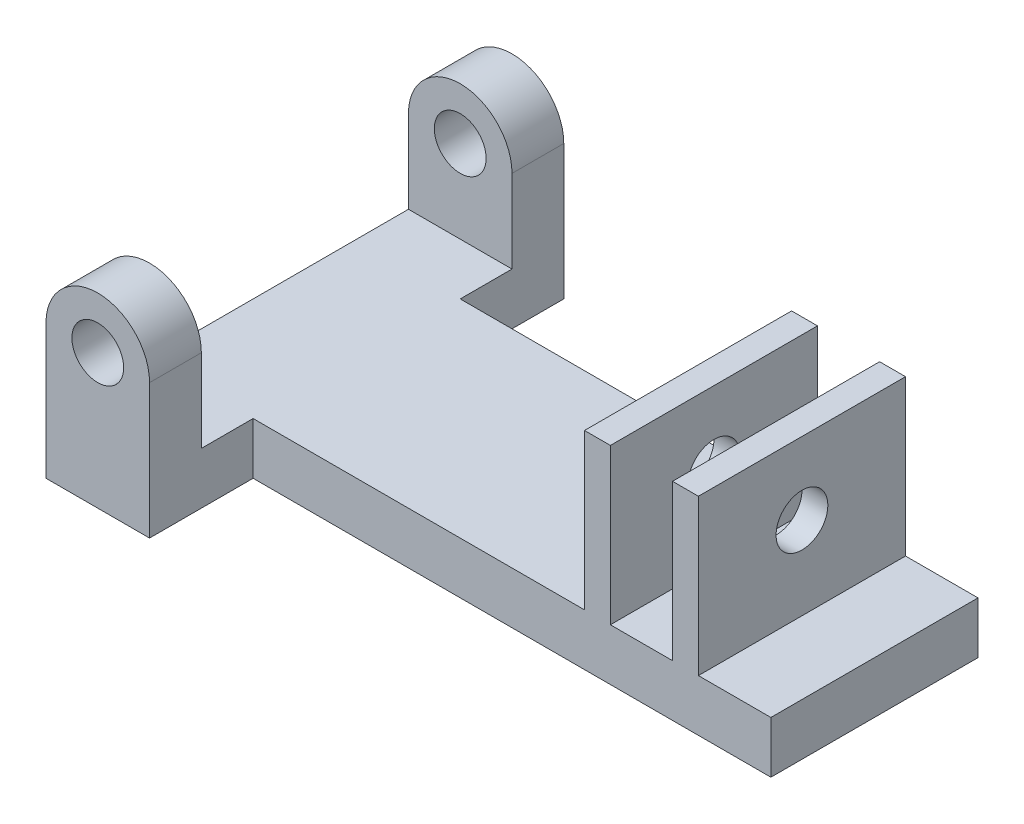
ISO-10303-21;
HEADER;
FILE_DESCRIPTION(('STEP AP214'),'2;1');
FILE_NAME('part.step','',(''),(''),'','','');
FILE_SCHEMA(('AUTOMOTIVE_DESIGN { 1 0 10303 214 1 1 1 1 }'));
ENDSEC;
DATA;
#1=APPLICATION_CONTEXT('core data for automotive mechanical design processes');
#2=APPLICATION_PROTOCOL_DEFINITION('international standard','automotive_design',2000,#1);
#3=PRODUCT_CONTEXT('',#1,'mechanical');
#4=PRODUCT('Part','Part','',(#3));
#5=PRODUCT_RELATED_PRODUCT_CATEGORY('part','',(#4));
#6=PRODUCT_DEFINITION_FORMATION('','',#4);
#7=PRODUCT_DEFINITION_CONTEXT('part definition',#1,'design');
#8=PRODUCT_DEFINITION('design','',#6,#7);
#9=PRODUCT_DEFINITION_SHAPE('','',#8);
#10=(LENGTH_UNIT() NAMED_UNIT(*) SI_UNIT(.MILLI.,.METRE.));
#11=(NAMED_UNIT(*) PLANE_ANGLE_UNIT() SI_UNIT($,.RADIAN.));
#12=(NAMED_UNIT(*) SI_UNIT($,.STERADIAN.) SOLID_ANGLE_UNIT());
#13=UNCERTAINTY_MEASURE_WITH_UNIT(LENGTH_MEASURE(1.E-05),#10,'distance_accuracy_value','');
#14=(GEOMETRIC_REPRESENTATION_CONTEXT(3) GLOBAL_UNCERTAINTY_ASSIGNED_CONTEXT((#13)) GLOBAL_UNIT_ASSIGNED_CONTEXT((#10,
#11,#12)) REPRESENTATION_CONTEXT('',''));
#15=CARTESIAN_POINT('',(0.,0.,0.));
#16=DIRECTION('',(0.,0.,1.));
#17=DIRECTION('',(1.,0.,0.));
#18=AXIS2_PLACEMENT_3D('',#15,#16,#17);
#19=CARTESIAN_POINT('',(0.,6.35,0.));
#20=DIRECTION('',(0.,-1.,0.));
#21=DIRECTION('',(0.,0.,-1.));
#22=AXIS2_PLACEMENT_3D('',#19,#20,#21);
#23=PLANE('',#22);
#24=DIRECTION('',(0.,0.,-1.));
#25=VECTOR('',#24,1.);
#26=CARTESIAN_POINT('',(54.61,6.35,-38.1));
#27=LINE('',#26,#25);
#28=CARTESIAN_POINT('',(54.61,6.35,-12.7));
#29=VERTEX_POINT('',#28);
#30=CARTESIAN_POINT('',(54.61,6.35,-38.1));
#31=VERTEX_POINT('',#30);
#32=EDGE_CURVE('E64',#29,#31,#27,.T.);
#33=ORIENTED_EDGE('',*,*,#32,.F.);
#34=DIRECTION('',(-1.,0.,0.));
#35=VECTOR('',#34,1.);
#36=CARTESIAN_POINT('',(63.5,6.35,-12.7));
#37=LINE('',#36,#35);
#38=CARTESIAN_POINT('',(63.5,6.35,-12.7));
#39=VERTEX_POINT('',#38);
#40=EDGE_CURVE('E261',#39,#29,#37,.T.);
#41=ORIENTED_EDGE('',*,*,#40,.F.);
#42=DIRECTION('',(0.,0.,1.));
#43=VECTOR('',#42,1.);
#44=CARTESIAN_POINT('',(63.5,6.35,-12.7));
#45=LINE('',#44,#43);
#46=CARTESIAN_POINT('',(63.5,6.35,-38.1));
#47=VERTEX_POINT('',#46);
#48=EDGE_CURVE('E255',#47,#39,#45,.T.);
#49=ORIENTED_EDGE('',*,*,#48,.F.);
#50=DIRECTION('',(-1.,0.,0.));
#51=VECTOR('',#50,1.);
#52=CARTESIAN_POINT('',(63.5,6.35,-38.1));
#53=LINE('',#52,#51);
#54=EDGE_CURVE('E190',#47,#31,#53,.T.);
#55=ORIENTED_EDGE('',*,*,#54,.T.);
#56=EDGE_LOOP('',(#33,#41,#49,#55));
#57=FACE_BOUND('',#56,.T.);
#58=ADVANCED_FACE('F40',(#57),#23,.F.);
#59=DIRECTION('',(0.,0.,1.));
#60=VECTOR('',#59,1.);
#61=CARTESIAN_POINT('',(51.435,6.35,-38.1));
#62=LINE('',#61,#60);
#63=CARTESIAN_POINT('',(51.435,6.35,-38.1));
#64=VERTEX_POINT('',#63);
#65=CARTESIAN_POINT('',(51.435,6.35,-12.7));
#66=VERTEX_POINT('',#65);
#67=EDGE_CURVE('E193',#64,#66,#62,.T.);
#68=ORIENTED_EDGE('',*,*,#67,.F.);
#69=CARTESIAN_POINT('',(43.815,6.35,-38.1));
#70=VERTEX_POINT('',#69);
#71=EDGE_CURVE('E180',#64,#70,#53,.T.);
#72=ORIENTED_EDGE('',*,*,#71,.T.);
#73=DIRECTION('',(0.,0.,-1.));
#74=VECTOR('',#73,1.);
#75=CARTESIAN_POINT('',(43.815,6.35,-38.1));
#76=LINE('',#75,#74);
#77=CARTESIAN_POINT('',(43.815,6.35,-12.7));
#78=VERTEX_POINT('',#77);
#79=EDGE_CURVE('E227',#78,#70,#76,.T.);
#80=ORIENTED_EDGE('',*,*,#79,.F.);
#81=EDGE_CURVE('E56',#66,#78,#37,.T.);
#82=ORIENTED_EDGE('',*,*,#81,.F.);
#83=EDGE_LOOP('',(#68,#72,#80,#82));
#84=FACE_BOUND('',#83,.T.);
#85=ADVANCED_FACE('F194',(#84),#23,.F.);
#86=DIRECTION('',(0.,0.,1.));
#87=VECTOR('',#86,1.);
#88=CARTESIAN_POINT('',(40.64,6.35,-38.1));
#89=LINE('',#88,#87);
#90=CARTESIAN_POINT('',(40.64,6.35,-38.1));
#91=VERTEX_POINT('',#90);
#92=CARTESIAN_POINT('',(40.64,6.35,-12.7));
#93=VERTEX_POINT('',#92);
#94=EDGE_CURVE('E216',#91,#93,#89,.T.);
#95=ORIENTED_EDGE('',*,*,#94,.F.);
#96=CARTESIAN_POINT('',(0.,6.35,-38.1));
#97=VERTEX_POINT('',#96);
#98=EDGE_CURVE('E191',#91,#97,#53,.T.);
#99=ORIENTED_EDGE('',*,*,#98,.T.);
#100=DIRECTION('',(0.,0.,-1.));
#101=VECTOR('',#100,1.);
#102=CARTESIAN_POINT('',(0.,6.35,0.));
#103=LINE('',#102,#101);
#104=CARTESIAN_POINT('',(0.,6.35,-44.45));
#105=VERTEX_POINT('',#104);
#106=EDGE_CURVE('E326',#97,#105,#103,.T.);
#107=ORIENTED_EDGE('',*,*,#106,.T.);
#108=DIRECTION('',(-1.,0.,0.));
#109=VECTOR('',#108,1.);
#110=CARTESIAN_POINT('',(-12.7,6.35,-44.45));
#111=LINE('',#110,#109);
#112=CARTESIAN_POINT('',(-12.7,6.35,-44.45));
#113=VERTEX_POINT('',#112);
#114=EDGE_CURVE('E289',#105,#113,#111,.T.);
#115=ORIENTED_EDGE('',*,*,#114,.T.);
#116=DIRECTION('',(0.,0.,1.));
#117=VECTOR('',#116,1.);
#118=CARTESIAN_POINT('',(-12.7,6.35,0.));
#119=LINE('',#118,#117);
#120=CARTESIAN_POINT('',(-12.7,6.35,-6.35));
#121=VERTEX_POINT('',#120);
#122=EDGE_CURVE('E325',#113,#121,#119,.T.);
#123=ORIENTED_EDGE('',*,*,#122,.T.);
#124=DIRECTION('',(-1.,0.,0.));
#125=VECTOR('',#124,1.);
#126=CARTESIAN_POINT('',(-12.7,6.35,-6.35));
#127=LINE('',#126,#125);
#128=CARTESIAN_POINT('',(0.,6.35,-6.35));
#129=VERTEX_POINT('',#128);
#130=EDGE_CURVE('E306',#129,#121,#127,.T.);
#131=ORIENTED_EDGE('',*,*,#130,.F.);
#132=CARTESIAN_POINT('',(0.,6.35,-12.7));
#133=VERTEX_POINT('',#132);
#134=EDGE_CURVE('E322',#129,#133,#103,.T.);
#135=ORIENTED_EDGE('',*,*,#134,.T.);
#136=EDGE_CURVE('E257',#93,#133,#37,.T.);
#137=ORIENTED_EDGE('',*,*,#136,.F.);
#138=EDGE_LOOP('',(#95,#99,#107,#115,#123,#131,#135,#137));
#139=FACE_BOUND('',#138,.T.);
#140=ADVANCED_FACE('F371',(#139),#23,.F.);
#141=CARTESIAN_POINT('',(0.,6.35,0.));
#142=DIRECTION('',(-1.,0.,0.));
#143=DIRECTION('',(0.,0.,1.));
#144=AXIS2_PLACEMENT_3D('',#141,#142,#143);
#145=PLANE('',#144);
#146=DIRECTION('',(0.,-1.,0.));
#147=VECTOR('',#146,1.);
#148=CARTESIAN_POINT('',(0.,6.35,-12.7));
#149=LINE('',#148,#147);
#150=CARTESIAN_POINT('',(0.,0.,-12.7));
#151=VERTEX_POINT('',#150);
#152=EDGE_CURVE('E246',#133,#151,#149,.T.);
#153=ORIENTED_EDGE('',*,*,#152,.F.);
#154=ORIENTED_EDGE('',*,*,#134,.F.);
#155=DIRECTION('',(0.,-1.,0.));
#156=VECTOR('',#155,1.);
#157=CARTESIAN_POINT('',(0.,16.51,-6.35));
#158=LINE('',#157,#156);
#159=CARTESIAN_POINT('',(0.,16.51,-6.35));
#160=VERTEX_POINT('',#159);
#161=EDGE_CURVE('E318',#160,#129,#158,.T.);
#162=ORIENTED_EDGE('',*,*,#161,.F.);
#163=DIRECTION('',(0.,0.,-1.));
#164=VECTOR('',#163,1.);
#165=CARTESIAN_POINT('',(0.,16.51,0.));
#166=LINE('',#165,#164);
#167=CARTESIAN_POINT('',(0.,16.51,0.));
#168=VERTEX_POINT('',#167);
#169=EDGE_CURVE('E310',#168,#160,#166,.T.);
#170=ORIENTED_EDGE('',*,*,#169,.F.);
#171=DIRECTION('',(0.,-1.,0.));
#172=VECTOR('',#171,1.);
#173=CARTESIAN_POINT('',(0.,6.35,0.));
#174=LINE('',#173,#172);
#175=CARTESIAN_POINT('',(0.,0.,0.));
#176=VERTEX_POINT('',#175);
#177=EDGE_CURVE('E328',#168,#176,#174,.T.);
#178=ORIENTED_EDGE('',*,*,#177,.T.);
#179=DIRECTION('',(0.,0.,-1.));
#180=VECTOR('',#179,1.);
#181=CARTESIAN_POINT('',(0.,0.,0.));
#182=LINE('',#181,#180);
#183=EDGE_CURVE('E329',#176,#151,#182,.T.);
#184=ORIENTED_EDGE('',*,*,#183,.T.);
#185=EDGE_LOOP('',(#153,#154,#162,#170,#178,#184));
#186=FACE_BOUND('',#185,.T.);
#187=ADVANCED_FACE('F42',(#186),#145,.F.);
#188=DIRECTION('',(0.,1.,0.));
#189=VECTOR('',#188,1.);
#190=CARTESIAN_POINT('',(0.,6.35,-38.1));
#191=LINE('',#190,#189);
#192=CARTESIAN_POINT('',(0.,0.,-38.1));
#193=VERTEX_POINT('',#192);
#194=EDGE_CURVE('E251',#193,#97,#191,.T.);
#195=ORIENTED_EDGE('',*,*,#194,.F.);
#196=CARTESIAN_POINT('',(0.,0.,-50.8));
#197=VERTEX_POINT('',#196);
#198=EDGE_CURVE('E321',#193,#197,#182,.T.);
#199=ORIENTED_EDGE('',*,*,#198,.T.);
#200=DIRECTION('',(0.,-1.,0.));
#201=VECTOR('',#200,1.);
#202=CARTESIAN_POINT('',(0.,6.35,-50.8));
#203=LINE('',#202,#201);
#204=CARTESIAN_POINT('',(0.,16.51,-50.8));
#205=VERTEX_POINT('',#204);
#206=EDGE_CURVE('E11',#205,#197,#203,.T.);
#207=ORIENTED_EDGE('',*,*,#206,.F.);
#208=DIRECTION('',(0.,0.,1.));
#209=VECTOR('',#208,1.);
#210=CARTESIAN_POINT('',(0.,16.51,-50.8));
#211=LINE('',#210,#209);
#212=CARTESIAN_POINT('',(0.,16.51,-44.45));
#213=VERTEX_POINT('',#212);
#214=EDGE_CURVE('E295',#205,#213,#211,.T.);
#215=ORIENTED_EDGE('',*,*,#214,.T.);
#216=DIRECTION('',(0.,-1.,0.));
#217=VECTOR('',#216,1.);
#218=CARTESIAN_POINT('',(0.,16.51,-44.45));
#219=LINE('',#218,#217);
#220=EDGE_CURVE('E298',#213,#105,#219,.T.);
#221=ORIENTED_EDGE('',*,*,#220,.T.);
#222=ORIENTED_EDGE('',*,*,#106,.F.);
#223=EDGE_LOOP('',(#195,#199,#207,#215,#221,#222));
#224=FACE_BOUND('',#223,.T.);
#225=ADVANCED_FACE('F383',(#224),#145,.F.);
#226=CARTESIAN_POINT('',(-12.7,6.35,-50.8));
#227=DIRECTION('',(0.,0.,1.));
#228=DIRECTION('',(1.,0.,0.));
#229=AXIS2_PLACEMENT_3D('',#226,#227,#228);
#230=PLANE('',#229);
#231=CARTESIAN_POINT('',(-6.35,16.51,-50.8));
#232=DIRECTION('',(0.,0.,1.));
#233=DIRECTION('',(1.,0.,0.));
#234=AXIS2_PLACEMENT_3D('',#231,#232,#233);
#235=CIRCLE('',#234,3.175);
#236=CARTESIAN_POINT('',(-3.175,16.51,-50.8));
#237=VERTEX_POINT('',#236);
#238=EDGE_CURVE('E269',#237,#237,#235,.T.);
#239=ORIENTED_EDGE('',*,*,#238,.T.);
#240=EDGE_LOOP('',(#239));
#241=FACE_BOUND('',#240,.T.);
#242=DIRECTION('',(-1.,0.,0.));
#243=VECTOR('',#242,1.);
#244=CARTESIAN_POINT('',(-12.7,0.,-50.8));
#245=LINE('',#244,#243);
#246=CARTESIAN_POINT('',(-12.7,0.,-50.8));
#247=VERTEX_POINT('',#246);
#248=EDGE_CURVE('E331',#197,#247,#245,.T.);
#249=ORIENTED_EDGE('',*,*,#248,.T.);
#250=DIRECTION('',(0.,-1.,0.));
#251=VECTOR('',#250,1.);
#252=CARTESIAN_POINT('',(-12.7,6.35,-50.8));
#253=LINE('',#252,#251);
#254=CARTESIAN_POINT('',(-12.7,16.51,-50.8));
#255=VERTEX_POINT('',#254);
#256=EDGE_CURVE('E49',#255,#247,#253,.T.);
#257=ORIENTED_EDGE('',*,*,#256,.F.);
#258=CARTESIAN_POINT('',(-6.35,16.51,-50.8));
#259=DIRECTION('',(0.,0.,1.));
#260=DIRECTION('',(-1.,0.,0.));
#261=AXIS2_PLACEMENT_3D('',#258,#259,#260);
#262=CIRCLE('',#261,6.35);
#263=EDGE_CURVE('E275',#205,#255,#262,.T.);
#264=ORIENTED_EDGE('',*,*,#263,.F.);
#265=ORIENTED_EDGE('',*,*,#206,.T.);
#266=EDGE_LOOP('',(#249,#257,#264,#265));
#267=FACE_BOUND('',#266,.T.);
#268=ADVANCED_FACE('F380',(#241,#267),#230,.F.);
#269=CARTESIAN_POINT('',(-12.7,6.35,0.));
#270=DIRECTION('',(1.,0.,0.));
#271=DIRECTION('',(0.,0.,-1.));
#272=AXIS2_PLACEMENT_3D('',#269,#270,#271);
#273=PLANE('',#272);
#274=DIRECTION('',(0.,0.,1.));
#275=VECTOR('',#274,1.);
#276=CARTESIAN_POINT('',(-12.7,0.,0.));
#277=LINE('',#276,#275);
#278=CARTESIAN_POINT('',(-12.7,0.,0.));
#279=VERTEX_POINT('',#278);
#280=EDGE_CURVE('E333',#247,#279,#277,.T.);
#281=ORIENTED_EDGE('',*,*,#280,.T.);
#282=DIRECTION('',(0.,-1.,0.));
#283=VECTOR('',#282,1.);
#284=CARTESIAN_POINT('',(-12.7,6.35,0.));
#285=LINE('',#284,#283);
#286=CARTESIAN_POINT('',(-12.7,16.51,0.));
#287=VERTEX_POINT('',#286);
#288=EDGE_CURVE('E339',#287,#279,#285,.T.);
#289=ORIENTED_EDGE('',*,*,#288,.F.);
#290=DIRECTION('',(0.,0.,1.));
#291=VECTOR('',#290,1.);
#292=CARTESIAN_POINT('',(-12.7,16.51,0.));
#293=LINE('',#292,#291);
#294=CARTESIAN_POINT('',(-12.7,16.51,-6.35));
#295=VERTEX_POINT('',#294);
#296=EDGE_CURVE('E307',#295,#287,#293,.T.);
#297=ORIENTED_EDGE('',*,*,#296,.F.);
#298=DIRECTION('',(0.,-1.,0.));
#299=VECTOR('',#298,1.);
#300=CARTESIAN_POINT('',(-12.7,16.51,-6.35));
#301=LINE('',#300,#299);
#302=EDGE_CURVE('E313',#295,#121,#301,.T.);
#303=ORIENTED_EDGE('',*,*,#302,.T.);
#304=ORIENTED_EDGE('',*,*,#122,.F.);
#305=DIRECTION('',(0.,-1.,0.));
#306=VECTOR('',#305,1.);
#307=CARTESIAN_POINT('',(-12.7,16.51,-44.45));
#308=LINE('',#307,#306);
#309=CARTESIAN_POINT('',(-12.7,16.51,-44.45));
#310=VERTEX_POINT('',#309);
#311=EDGE_CURVE('E303',#310,#113,#308,.T.);
#312=ORIENTED_EDGE('',*,*,#311,.F.);
#313=DIRECTION('',(0.,0.,-1.));
#314=VECTOR('',#313,1.);
#315=CARTESIAN_POINT('',(-12.7,16.51,-50.8));
#316=LINE('',#315,#314);
#317=EDGE_CURVE('E292',#310,#255,#316,.T.);
#318=ORIENTED_EDGE('',*,*,#317,.T.);
#319=ORIENTED_EDGE('',*,*,#256,.T.);
#320=EDGE_LOOP('',(#281,#289,#297,#303,#304,#312,#318,#319));
#321=FACE_BOUND('',#320,.T.);
#322=ADVANCED_FACE('F346',(#321),#273,.F.);
#323=CARTESIAN_POINT('',(-12.7,6.35,0.));
#324=DIRECTION('',(0.,0.,-1.));
#325=DIRECTION('',(-1.,0.,0.));
#326=AXIS2_PLACEMENT_3D('',#323,#324,#325);
#327=PLANE('',#326);
#328=CARTESIAN_POINT('',(-6.35,16.51,0.));
#329=DIRECTION('',(0.,0.,1.));
#330=DIRECTION('',(1.,0.,0.));
#331=AXIS2_PLACEMENT_3D('',#328,#329,#330);
#332=CIRCLE('',#331,3.175);
#333=CARTESIAN_POINT('',(-3.175,16.51,0.));
#334=VERTEX_POINT('',#333);
#335=EDGE_CURVE('E278',#334,#334,#332,.T.);
#336=ORIENTED_EDGE('',*,*,#335,.F.);
#337=EDGE_LOOP('',(#336));
#338=FACE_BOUND('',#337,.T.);
#339=DIRECTION('',(1.,0.,0.));
#340=VECTOR('',#339,1.);
#341=CARTESIAN_POINT('',(-12.7,0.,0.));
#342=LINE('',#341,#340);
#343=EDGE_CURVE('E335',#279,#176,#342,.T.);
#344=ORIENTED_EDGE('',*,*,#343,.T.);
#345=ORIENTED_EDGE('',*,*,#177,.F.);
#346=CARTESIAN_POINT('',(-6.35,16.51,0.));
#347=DIRECTION('',(0.,0.,1.));
#348=DIRECTION('',(-1.,0.,0.));
#349=AXIS2_PLACEMENT_3D('',#346,#347,#348);
#350=CIRCLE('',#349,6.35);
#351=EDGE_CURVE('E285',#168,#287,#350,.T.);
#352=ORIENTED_EDGE('',*,*,#351,.T.);
#353=ORIENTED_EDGE('',*,*,#288,.T.);
#354=EDGE_LOOP('',(#344,#345,#352,#353));
#355=FACE_BOUND('',#354,.T.);
#356=ADVANCED_FACE('F357',(#338,#355),#327,.F.);
#357=CARTESIAN_POINT('',(0.,0.,0.));
#358=DIRECTION('',(0.,-1.,0.));
#359=DIRECTION('',(0.,0.,-1.));
#360=AXIS2_PLACEMENT_3D('',#357,#358,#359);
#361=PLANE('',#360);
#362=ORIENTED_EDGE('',*,*,#183,.F.);
#363=ORIENTED_EDGE('',*,*,#343,.F.);
#364=ORIENTED_EDGE('',*,*,#280,.F.);
#365=ORIENTED_EDGE('',*,*,#248,.F.);
#366=ORIENTED_EDGE('',*,*,#198,.F.);
#367=DIRECTION('',(-1.,0.,0.));
#368=VECTOR('',#367,1.);
#369=CARTESIAN_POINT('',(63.5,0.,-38.1));
#370=LINE('',#369,#368);
#371=CARTESIAN_POINT('',(63.5,0.,-38.1));
#372=VERTEX_POINT('',#371);
#373=EDGE_CURVE('E263',#372,#193,#370,.T.);
#374=ORIENTED_EDGE('',*,*,#373,.F.);
#375=DIRECTION('',(0.,0.,-1.));
#376=VECTOR('',#375,1.);
#377=CARTESIAN_POINT('',(63.5,0.,-12.7));
#378=LINE('',#377,#376);
#379=CARTESIAN_POINT('',(63.5,0.,-12.7));
#380=VERTEX_POINT('',#379);
#381=EDGE_CURVE('E250',#380,#372,#378,.T.);
#382=ORIENTED_EDGE('',*,*,#381,.F.);
#383=DIRECTION('',(-1.,0.,0.));
#384=VECTOR('',#383,1.);
#385=CARTESIAN_POINT('',(63.5,0.,-12.7));
#386=LINE('',#385,#384);
#387=EDGE_CURVE('E266',#380,#151,#386,.T.);
#388=ORIENTED_EDGE('',*,*,#387,.T.);
#389=EDGE_LOOP('',(#362,#363,#364,#365,#366,#374,#382,#388));
#390=FACE_BOUND('',#389,.T.);
#391=ADVANCED_FACE('F354',(#390),#361,.T.);
#392=CARTESIAN_POINT('',(-12.7,16.51,-6.35));
#393=DIRECTION('',(0.,0.,1.));
#394=DIRECTION('',(1.,0.,0.));
#395=AXIS2_PLACEMENT_3D('',#392,#393,#394);
#396=PLANE('',#395);
#397=CARTESIAN_POINT('',(-6.35,16.51,-6.35));
#398=DIRECTION('',(0.,0.,1.));
#399=DIRECTION('',(1.,0.,0.));
#400=AXIS2_PLACEMENT_3D('',#397,#398,#399);
#401=CIRCLE('',#400,3.175);
#402=CARTESIAN_POINT('',(-3.175,16.51,-6.35));
#403=VERTEX_POINT('',#402);
#404=EDGE_CURVE('E282',#403,#403,#401,.F.);
#405=ORIENTED_EDGE('',*,*,#404,.F.);
#406=EDGE_LOOP('',(#405));
#407=FACE_BOUND('',#406,.T.);
#408=ORIENTED_EDGE('',*,*,#130,.T.);
#409=ORIENTED_EDGE('',*,*,#302,.F.);
#410=CARTESIAN_POINT('',(-6.35,16.51,-6.35));
#411=DIRECTION('',(0.,0.,1.));
#412=DIRECTION('',(-1.,0.,0.));
#413=AXIS2_PLACEMENT_3D('',#410,#411,#412);
#414=CIRCLE('',#413,6.35);
#415=EDGE_CURVE('E286',#160,#295,#414,.T.);
#416=ORIENTED_EDGE('',*,*,#415,.F.);
#417=ORIENTED_EDGE('',*,*,#161,.T.);
#418=EDGE_LOOP('',(#408,#409,#416,#417));
#419=FACE_BOUND('',#418,.T.);
#420=ADVANCED_FACE('F366',(#407,#419),#396,.F.);
#421=CARTESIAN_POINT('',(-12.7,16.51,-44.45));
#422=DIRECTION('',(0.,0.,1.));
#423=DIRECTION('',(1.,0.,0.));
#424=AXIS2_PLACEMENT_3D('',#421,#422,#423);
#425=PLANE('',#424);
#426=CARTESIAN_POINT('',(-6.35,16.51,-44.45));
#427=DIRECTION('',(0.,0.,-1.));
#428=DIRECTION('',(-1.,0.,0.));
#429=AXIS2_PLACEMENT_3D('',#426,#427,#428);
#430=CIRCLE('',#429,3.175);
#431=CARTESIAN_POINT('',(-9.525,16.51,-44.45));
#432=VERTEX_POINT('',#431);
#433=EDGE_CURVE('E272',#432,#432,#430,.T.);
#434=ORIENTED_EDGE('',*,*,#433,.T.);
#435=EDGE_LOOP('',(#434));
#436=FACE_BOUND('',#435,.T.);
#437=ORIENTED_EDGE('',*,*,#114,.F.);
#438=ORIENTED_EDGE('',*,*,#220,.F.);
#439=CARTESIAN_POINT('',(-6.35,16.51,-44.45));
#440=DIRECTION('',(0.,0.,1.));
#441=DIRECTION('',(-1.,0.,0.));
#442=AXIS2_PLACEMENT_3D('',#439,#440,#441);
#443=CIRCLE('',#442,6.35);
#444=EDGE_CURVE('E276',#213,#310,#443,.T.);
#445=ORIENTED_EDGE('',*,*,#444,.T.);
#446=ORIENTED_EDGE('',*,*,#311,.T.);
#447=EDGE_LOOP('',(#437,#438,#445,#446));
#448=FACE_BOUND('',#447,.T.);
#449=ADVANCED_FACE('F375',(#436,#448),#425,.T.);
#450=CARTESIAN_POINT('',(-6.35,16.51,-6.35));
#451=DIRECTION('',(0.,0.,1.));
#452=DIRECTION('',(1.,0.,0.));
#453=AXIS2_PLACEMENT_3D('',#450,#451,#452);
#454=CYLINDRICAL_SURFACE('',#453,6.35);
#455=ORIENTED_EDGE('',*,*,#351,.F.);
#456=ORIENTED_EDGE('',*,*,#169,.T.);
#457=ORIENTED_EDGE('',*,*,#415,.T.);
#458=ORIENTED_EDGE('',*,*,#296,.T.);
#459=EDGE_LOOP('',(#455,#456,#457,#458));
#460=FACE_BOUND('',#459,.T.);
#461=ADVANCED_FACE('F364',(#460),#454,.T.);
#462=CARTESIAN_POINT('',(-6.35,16.51,-15.3302561210692));
#463=DIRECTION('',(0.,0.,1.));
#464=DIRECTION('',(1.,0.,0.));
#465=AXIS2_PLACEMENT_3D('',#462,#463,#464);
#466=CYLINDRICAL_SURFACE('',#465,3.175);
#467=ORIENTED_EDGE('',*,*,#404,.T.);
#468=EDGE_LOOP('',(#467));
#469=FACE_BOUND('',#468,.T.);
#470=ORIENTED_EDGE('',*,*,#335,.T.);
#471=EDGE_LOOP('',(#470));
#472=FACE_BOUND('',#471,.T.);
#473=ADVANCED_FACE('F464',(#469,#472),#466,.F.);
#474=CARTESIAN_POINT('',(-6.35,16.51,-44.45));
#475=DIRECTION('',(0.,0.,-1.));
#476=DIRECTION('',(-1.,0.,0.));
#477=AXIS2_PLACEMENT_3D('',#474,#475,#476);
#478=CYLINDRICAL_SURFACE('',#477,6.35);
#479=ORIENTED_EDGE('',*,*,#263,.T.);
#480=ORIENTED_EDGE('',*,*,#317,.F.);
#481=ORIENTED_EDGE('',*,*,#444,.F.);
#482=ORIENTED_EDGE('',*,*,#214,.F.);
#483=EDGE_LOOP('',(#479,#480,#481,#482));
#484=FACE_BOUND('',#483,.T.);
#485=ADVANCED_FACE('F378',(#484),#478,.T.);
#486=CARTESIAN_POINT('',(-6.35,16.51,2.63025612106916));
#487=DIRECTION('',(0.,0.,-1.));
#488=DIRECTION('',(-1.,0.,0.));
#489=AXIS2_PLACEMENT_3D('',#486,#487,#488);
#490=CYLINDRICAL_SURFACE('',#489,3.175);
#491=ORIENTED_EDGE('',*,*,#433,.F.);
#492=EDGE_LOOP('',(#491));
#493=FACE_BOUND('',#492,.T.);
#494=ORIENTED_EDGE('',*,*,#238,.F.);
#495=EDGE_LOOP('',(#494));
#496=FACE_BOUND('',#495,.T.);
#497=ADVANCED_FACE('F470',(#493,#496),#490,.F.);
#498=CARTESIAN_POINT('',(63.5,6.35,-12.7));
#499=DIRECTION('',(0.,0.,-1.));
#500=DIRECTION('',(0.,1.,0.));
#501=AXIS2_PLACEMENT_3D('',#498,#499,#500);
#502=PLANE('',#501);
#503=ORIENTED_EDGE('',*,*,#152,.T.);
#504=ORIENTED_EDGE('',*,*,#387,.F.);
#505=DIRECTION('',(0.,-1.,0.));
#506=VECTOR('',#505,1.);
#507=CARTESIAN_POINT('',(63.5,6.35,-12.7));
#508=LINE('',#507,#506);
#509=EDGE_CURVE('E247',#39,#380,#508,.T.);
#510=ORIENTED_EDGE('',*,*,#509,.F.);
#511=ORIENTED_EDGE('',*,*,#40,.T.);
#512=DIRECTION('',(0.,-1.,0.));
#513=VECTOR('',#512,1.);
#514=CARTESIAN_POINT('',(54.61,25.4,-12.7));
#515=LINE('',#514,#513);
#516=CARTESIAN_POINT('',(54.61,25.4,-12.7));
#517=VERTEX_POINT('',#516);
#518=EDGE_CURVE('E205',#517,#29,#515,.T.);
#519=ORIENTED_EDGE('',*,*,#518,.F.);
#520=DIRECTION('',(1.,0.,0.));
#521=VECTOR('',#520,1.);
#522=CARTESIAN_POINT('',(54.61,25.4,-12.7));
#523=LINE('',#522,#521);
#524=CARTESIAN_POINT('',(51.435,25.4,-12.7));
#525=VERTEX_POINT('',#524);
#526=EDGE_CURVE('E213',#525,#517,#523,.T.);
#527=ORIENTED_EDGE('',*,*,#526,.F.);
#528=DIRECTION('',(0.,-1.,0.));
#529=VECTOR('',#528,1.);
#530=CARTESIAN_POINT('',(51.435,25.4,-12.7));
#531=LINE('',#530,#529);
#532=EDGE_CURVE('E202',#525,#66,#531,.T.);
#533=ORIENTED_EDGE('',*,*,#532,.T.);
#534=ORIENTED_EDGE('',*,*,#81,.T.);
#535=DIRECTION('',(0.,-1.,0.));
#536=VECTOR('',#535,1.);
#537=CARTESIAN_POINT('',(43.815,25.4,-12.7));
#538=LINE('',#537,#536);
#539=CARTESIAN_POINT('',(43.815,25.4,-12.7));
#540=VERTEX_POINT('',#539);
#541=EDGE_CURVE('E240',#540,#78,#538,.T.);
#542=ORIENTED_EDGE('',*,*,#541,.F.);
#543=DIRECTION('',(1.,0.,0.));
#544=VECTOR('',#543,1.);
#545=CARTESIAN_POINT('',(40.64,25.4,-12.7));
#546=LINE('',#545,#544);
#547=CARTESIAN_POINT('',(40.64,25.4,-12.7));
#548=VERTEX_POINT('',#547);
#549=EDGE_CURVE('E226',#548,#540,#546,.T.);
#550=ORIENTED_EDGE('',*,*,#549,.F.);
#551=DIRECTION('',(0.,-1.,0.));
#552=VECTOR('',#551,1.);
#553=CARTESIAN_POINT('',(40.64,25.4,-12.7));
#554=LINE('',#553,#552);
#555=EDGE_CURVE('E243',#548,#93,#554,.T.);
#556=ORIENTED_EDGE('',*,*,#555,.T.);
#557=ORIENTED_EDGE('',*,*,#136,.T.);
#558=EDGE_LOOP('',(#503,#504,#510,#511,#519,#527,#533,#534,#542,#550,#556,#557));
#559=FACE_BOUND('',#558,.T.);
#560=ADVANCED_FACE('F393',(#559),#502,.F.);
#561=CARTESIAN_POINT('',(63.5,6.35,-38.1));
#562=DIRECTION('',(0.,0.,1.));
#563=DIRECTION('',(1.,0.,0.));
#564=AXIS2_PLACEMENT_3D('',#561,#562,#563);
#565=PLANE('',#564);
#566=ORIENTED_EDGE('',*,*,#194,.T.);
#567=ORIENTED_EDGE('',*,*,#98,.F.);
#568=DIRECTION('',(0.,-1.,0.));
#569=VECTOR('',#568,1.);
#570=CARTESIAN_POINT('',(40.64,25.4,-38.1));
#571=LINE('',#570,#569);
#572=CARTESIAN_POINT('',(40.64,25.4,-38.1));
#573=VERTEX_POINT('',#572);
#574=EDGE_CURVE('E233',#573,#91,#571,.T.);
#575=ORIENTED_EDGE('',*,*,#574,.F.);
#576=DIRECTION('',(-1.,0.,0.));
#577=VECTOR('',#576,1.);
#578=CARTESIAN_POINT('',(40.64,25.4,-38.1));
#579=LINE('',#578,#577);
#580=CARTESIAN_POINT('',(43.815,25.4,-38.1));
#581=VERTEX_POINT('',#580);
#582=EDGE_CURVE('E231',#581,#573,#579,.T.);
#583=ORIENTED_EDGE('',*,*,#582,.F.);
#584=DIRECTION('',(0.,-1.,0.));
#585=VECTOR('',#584,1.);
#586=CARTESIAN_POINT('',(43.815,25.4,-38.1));
#587=LINE('',#586,#585);
#588=EDGE_CURVE('E188',#581,#70,#587,.T.);
#589=ORIENTED_EDGE('',*,*,#588,.T.);
#590=ORIENTED_EDGE('',*,*,#71,.F.);
#591=DIRECTION('',(0.,-1.,0.));
#592=VECTOR('',#591,1.);
#593=CARTESIAN_POINT('',(51.435,25.4,-38.1));
#594=LINE('',#593,#592);
#595=CARTESIAN_POINT('',(51.435,25.4,-38.1));
#596=VERTEX_POINT('',#595);
#597=EDGE_CURVE('E184',#596,#64,#594,.T.);
#598=ORIENTED_EDGE('',*,*,#597,.F.);
#599=DIRECTION('',(-1.,0.,0.));
#600=VECTOR('',#599,1.);
#601=CARTESIAN_POINT('',(54.61,25.4,-38.1));
#602=LINE('',#601,#600);
#603=CARTESIAN_POINT('',(54.61,25.4,-38.1));
#604=VERTEX_POINT('',#603);
#605=EDGE_CURVE('E219',#604,#596,#602,.T.);
#606=ORIENTED_EDGE('',*,*,#605,.F.);
#607=DIRECTION('',(0.,-1.,0.));
#608=VECTOR('',#607,1.);
#609=CARTESIAN_POINT('',(54.61,25.4,-38.1));
#610=LINE('',#609,#608);
#611=EDGE_CURVE('E203',#604,#31,#610,.T.);
#612=ORIENTED_EDGE('',*,*,#611,.T.);
#613=ORIENTED_EDGE('',*,*,#54,.F.);
#614=DIRECTION('',(0.,1.,0.));
#615=VECTOR('',#614,1.);
#616=CARTESIAN_POINT('',(63.5,6.35,-38.1));
#617=LINE('',#616,#615);
#618=EDGE_CURVE('E253',#372,#47,#617,.T.);
#619=ORIENTED_EDGE('',*,*,#618,.F.);
#620=ORIENTED_EDGE('',*,*,#373,.T.);
#621=EDGE_LOOP('',(#566,#567,#575,#583,#589,#590,#598,#606,#612,#613,#619,#620));
#622=FACE_BOUND('',#621,.T.);
#623=ADVANCED_FACE('F182',(#622),#565,.F.);
#624=CARTESIAN_POINT('',(63.5,0.,0.));
#625=DIRECTION('',(1.,0.,0.));
#626=DIRECTION('',(0.,0.,-1.));
#627=AXIS2_PLACEMENT_3D('',#624,#625,#626);
#628=PLANE('',#627);
#629=ORIENTED_EDGE('',*,*,#509,.T.);
#630=ORIENTED_EDGE('',*,*,#381,.T.);
#631=ORIENTED_EDGE('',*,*,#618,.T.);
#632=ORIENTED_EDGE('',*,*,#48,.T.);
#633=EDGE_LOOP('',(#629,#630,#631,#632));
#634=FACE_BOUND('',#633,.T.);
#635=ADVANCED_FACE('F389',(#634),#628,.T.);
#636=CARTESIAN_POINT('',(40.64,25.4,-38.1));
#637=DIRECTION('',(1.,0.,0.));
#638=DIRECTION('',(0.,0.,-1.));
#639=AXIS2_PLACEMENT_3D('',#636,#637,#638);
#640=PLANE('',#639);
#641=CARTESIAN_POINT('',(40.64,16.51,-25.4));
#642=DIRECTION('',(1.,0.,0.));
#643=DIRECTION('',(0.,0.,-1.));
#644=AXIS2_PLACEMENT_3D('',#641,#642,#643);
#645=CIRCLE('',#644,3.175);
#646=CARTESIAN_POINT('',(40.64,16.51,-28.575));
#647=VERTEX_POINT('',#646);
#648=EDGE_CURVE('E502',#647,#647,#645,.F.);
#649=ORIENTED_EDGE('',*,*,#648,.F.);
#650=EDGE_LOOP('',(#649));
#651=FACE_BOUND('',#650,.T.);
#652=ORIENTED_EDGE('',*,*,#94,.T.);
#653=ORIENTED_EDGE('',*,*,#555,.F.);
#654=DIRECTION('',(0.,0.,1.));
#655=VECTOR('',#654,1.);
#656=CARTESIAN_POINT('',(40.64,25.4,-38.1));
#657=LINE('',#656,#655);
#658=EDGE_CURVE('E223',#573,#548,#657,.T.);
#659=ORIENTED_EDGE('',*,*,#658,.F.);
#660=ORIENTED_EDGE('',*,*,#574,.T.);
#661=EDGE_LOOP('',(#652,#653,#659,#660));
#662=FACE_BOUND('',#661,.T.);
#663=ADVANCED_FACE('F398',(#651,#662),#640,.F.);
#664=CARTESIAN_POINT('',(43.815,25.4,-38.1));
#665=DIRECTION('',(-1.,0.,0.));
#666=DIRECTION('',(0.,0.,1.));
#667=AXIS2_PLACEMENT_3D('',#664,#665,#666);
#668=PLANE('',#667);
#669=CARTESIAN_POINT('',(43.815,16.51,-25.4));
#670=DIRECTION('',(-1.,0.,0.));
#671=DIRECTION('',(0.,0.,1.));
#672=AXIS2_PLACEMENT_3D('',#669,#670,#671);
#673=CIRCLE('',#672,3.175);
#674=CARTESIAN_POINT('',(43.815,16.51,-22.225));
#675=VERTEX_POINT('',#674);
#676=EDGE_CURVE('E208',#675,#675,#673,.T.);
#677=ORIENTED_EDGE('',*,*,#676,.T.);
#678=EDGE_LOOP('',(#677));
#679=FACE_BOUND('',#678,.T.);
#680=ORIENTED_EDGE('',*,*,#79,.T.);
#681=ORIENTED_EDGE('',*,*,#588,.F.);
#682=DIRECTION('',(0.,0.,-1.));
#683=VECTOR('',#682,1.);
#684=CARTESIAN_POINT('',(43.815,25.4,-38.1));
#685=LINE('',#684,#683);
#686=EDGE_CURVE('E229',#540,#581,#685,.T.);
#687=ORIENTED_EDGE('',*,*,#686,.F.);
#688=ORIENTED_EDGE('',*,*,#541,.T.);
#689=EDGE_LOOP('',(#680,#681,#687,#688));
#690=FACE_BOUND('',#689,.T.);
#691=ADVANCED_FACE('F404',(#679,#690),#668,.F.);
#692=CARTESIAN_POINT('',(0.,25.4,0.));
#693=DIRECTION('',(0.,1.,0.));
#694=DIRECTION('',(0.,0.,1.));
#695=AXIS2_PLACEMENT_3D('',#692,#693,#694);
#696=PLANE('',#695);
#697=ORIENTED_EDGE('',*,*,#658,.T.);
#698=ORIENTED_EDGE('',*,*,#549,.T.);
#699=ORIENTED_EDGE('',*,*,#686,.T.);
#700=ORIENTED_EDGE('',*,*,#582,.T.);
#701=EDGE_LOOP('',(#697,#698,#699,#700));
#702=FACE_BOUND('',#701,.T.);
#703=ADVANCED_FACE('F401',(#702),#696,.T.);
#704=CARTESIAN_POINT('',(54.61,25.4,-38.1));
#705=DIRECTION('',(-1.,0.,0.));
#706=DIRECTION('',(0.,0.,1.));
#707=AXIS2_PLACEMENT_3D('',#704,#705,#706);
#708=PLANE('',#707);
#709=CARTESIAN_POINT('',(54.61,16.51,-25.4));
#710=DIRECTION('',(1.,0.,0.));
#711=DIRECTION('',(0.,0.,-1.));
#712=AXIS2_PLACEMENT_3D('',#709,#710,#711);
#713=CIRCLE('',#712,3.175);
#714=CARTESIAN_POINT('',(54.61,16.51,-28.575));
#715=VERTEX_POINT('',#714);
#716=EDGE_CURVE('E499',#715,#715,#713,.T.);
#717=ORIENTED_EDGE('',*,*,#716,.F.);
#718=EDGE_LOOP('',(#717));
#719=FACE_BOUND('',#718,.T.);
#720=ORIENTED_EDGE('',*,*,#32,.T.);
#721=ORIENTED_EDGE('',*,*,#611,.F.);
#722=DIRECTION('',(0.,0.,-1.));
#723=VECTOR('',#722,1.);
#724=CARTESIAN_POINT('',(54.61,25.4,-38.1));
#725=LINE('',#724,#723);
#726=EDGE_CURVE('E198',#517,#604,#725,.T.);
#727=ORIENTED_EDGE('',*,*,#726,.F.);
#728=ORIENTED_EDGE('',*,*,#518,.T.);
#729=EDGE_LOOP('',(#720,#721,#727,#728));
#730=FACE_BOUND('',#729,.T.);
#731=ADVANCED_FACE('F412',(#719,#730),#708,.F.);
#732=CARTESIAN_POINT('',(51.435,25.4,-38.1));
#733=DIRECTION('',(1.,0.,0.));
#734=DIRECTION('',(0.,0.,-1.));
#735=AXIS2_PLACEMENT_3D('',#732,#733,#734);
#736=PLANE('',#735);
#737=CARTESIAN_POINT('',(51.435,16.51,-25.4));
#738=DIRECTION('',(1.,0.,0.));
#739=DIRECTION('',(0.,0.,-1.));
#740=AXIS2_PLACEMENT_3D('',#737,#738,#739);
#741=CIRCLE('',#740,3.175);
#742=CARTESIAN_POINT('',(51.435,16.51,-28.575));
#743=VERTEX_POINT('',#742);
#744=EDGE_CURVE('E44',#743,#743,#741,.T.);
#745=ORIENTED_EDGE('',*,*,#744,.T.);
#746=EDGE_LOOP('',(#745));
#747=FACE_BOUND('',#746,.T.);
#748=ORIENTED_EDGE('',*,*,#67,.T.);
#749=ORIENTED_EDGE('',*,*,#532,.F.);
#750=DIRECTION('',(0.,0.,1.));
#751=VECTOR('',#750,1.);
#752=CARTESIAN_POINT('',(51.435,25.4,-38.1));
#753=LINE('',#752,#751);
#754=EDGE_CURVE('E201',#596,#525,#753,.T.);
#755=ORIENTED_EDGE('',*,*,#754,.F.);
#756=ORIENTED_EDGE('',*,*,#597,.T.);
#757=EDGE_LOOP('',(#748,#749,#755,#756));
#758=FACE_BOUND('',#757,.T.);
#759=ADVANCED_FACE('F200',(#747,#758),#736,.F.);
#760=CARTESIAN_POINT('',(0.,25.4,0.));
#761=DIRECTION('',(0.,-1.,0.));
#762=DIRECTION('',(0.,0.,-1.));
#763=AXIS2_PLACEMENT_3D('',#760,#761,#762);
#764=PLANE('',#763);
#765=ORIENTED_EDGE('',*,*,#726,.T.);
#766=ORIENTED_EDGE('',*,*,#605,.T.);
#767=ORIENTED_EDGE('',*,*,#754,.T.);
#768=ORIENTED_EDGE('',*,*,#526,.T.);
#769=EDGE_LOOP('',(#765,#766,#767,#768));
#770=FACE_BOUND('',#769,.T.);
#771=ADVANCED_FACE('F409',(#770),#764,.F.);
#772=CARTESIAN_POINT('',(31.6597438789309,16.51,-25.4));
#773=DIRECTION('',(1.,0.,0.));
#774=DIRECTION('',(0.,0.,-1.));
#775=AXIS2_PLACEMENT_3D('',#772,#773,#774);
#776=CYLINDRICAL_SURFACE('',#775,3.175);
#777=ORIENTED_EDGE('',*,*,#716,.T.);
#778=EDGE_LOOP('',(#777));
#779=FACE_BOUND('',#778,.T.);
#780=ORIENTED_EDGE('',*,*,#744,.F.);
#781=EDGE_LOOP('',(#780));
#782=FACE_BOUND('',#781,.T.);
#783=ADVANCED_FACE('F487',(#779,#782),#776,.F.);
#784=ORIENTED_EDGE('',*,*,#648,.T.);
#785=EDGE_LOOP('',(#784));
#786=FACE_BOUND('',#785,.T.);
#787=ORIENTED_EDGE('',*,*,#676,.F.);
#788=EDGE_LOOP('',(#787));
#789=FACE_BOUND('',#788,.T.);
#790=ADVANCED_FACE('F491',(#786,#789),#776,.F.);
#791=CLOSED_SHELL('',(#58,#85,#140,#187,#225,#268,#322,#356,#391,#420,#449,#461,#473,#485,#497,
#560,#623,#635,#663,#691,#703,#731,#759,#771,#783,#790));
#792=MANIFOLD_SOLID_BREP('B2',#791);
#793=ADVANCED_BREP_SHAPE_REPRESENTATION('',(#18,#792),#14);
#794=SHAPE_DEFINITION_REPRESENTATION(#9,#793);
ENDSEC;
END-ISO-10303-21;
